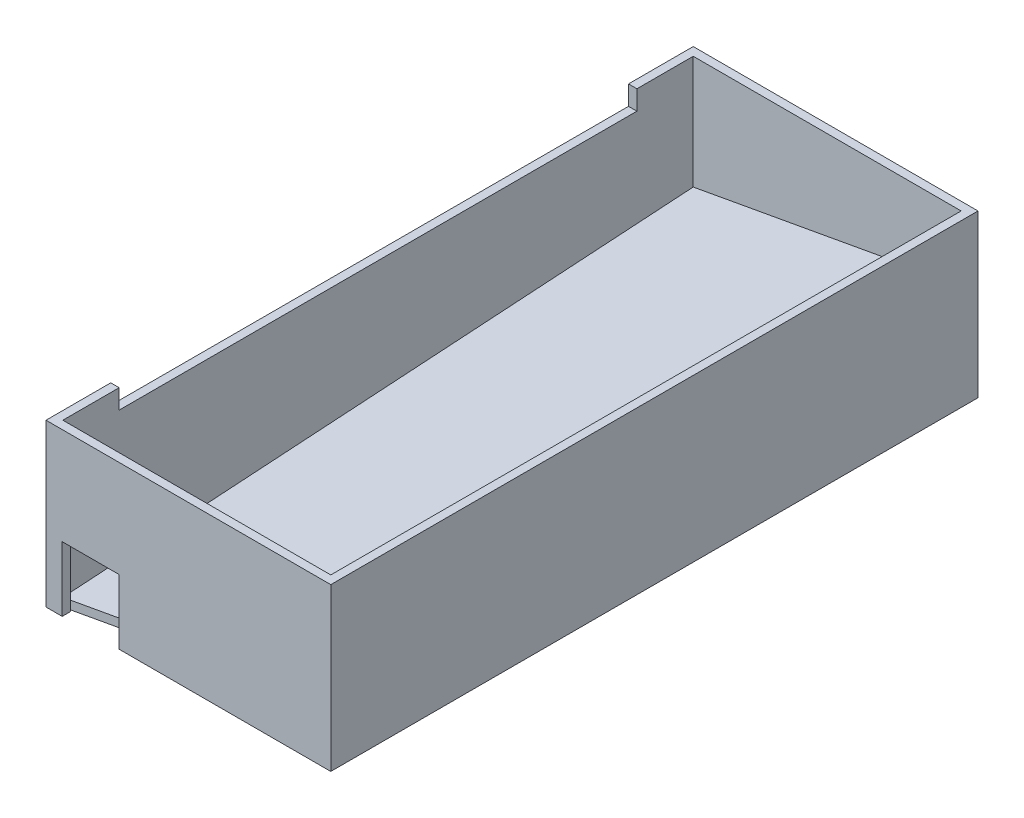
ISO-10303-21;
HEADER;
FILE_DESCRIPTION(('STEP AP214'),'2;1');
FILE_NAME('part.step','',(''),(''),'','','');
FILE_SCHEMA(('AUTOMOTIVE_DESIGN { 1 0 10303 214 1 1 1 1 }'));
ENDSEC;
DATA;
#1=APPLICATION_CONTEXT('core data for automotive mechanical design processes');
#2=APPLICATION_PROTOCOL_DEFINITION('international standard','automotive_design',2000,#1);
#3=PRODUCT_CONTEXT('',#1,'mechanical');
#4=PRODUCT('Part','Part','',(#3));
#5=PRODUCT_RELATED_PRODUCT_CATEGORY('part','',(#4));
#6=PRODUCT_DEFINITION_FORMATION('','',#4);
#7=PRODUCT_DEFINITION_CONTEXT('part definition',#1,'design');
#8=PRODUCT_DEFINITION('design','',#6,#7);
#9=PRODUCT_DEFINITION_SHAPE('','',#8);
#10=(LENGTH_UNIT() NAMED_UNIT(*) SI_UNIT(.MILLI.,.METRE.));
#11=(NAMED_UNIT(*) PLANE_ANGLE_UNIT() SI_UNIT($,.RADIAN.));
#12=(NAMED_UNIT(*) SI_UNIT($,.STERADIAN.) SOLID_ANGLE_UNIT());
#13=UNCERTAINTY_MEASURE_WITH_UNIT(LENGTH_MEASURE(1.E-05),#10,'distance_accuracy_value','');
#14=(GEOMETRIC_REPRESENTATION_CONTEXT(3) GLOBAL_UNCERTAINTY_ASSIGNED_CONTEXT((#13)) GLOBAL_UNIT_ASSIGNED_CONTEXT((#10,
#11,#12)) REPRESENTATION_CONTEXT('',''));
#15=CARTESIAN_POINT('',(0.,0.,0.));
#16=DIRECTION('',(0.,0.,1.));
#17=DIRECTION('',(1.,0.,0.));
#18=AXIS2_PLACEMENT_3D('',#15,#16,#17);
#19=CARTESIAN_POINT('',(3.302,15.748,-250.698));
#20=DIRECTION('',(-1.,0.,0.));
#21=DIRECTION('',(0.,0.,1.));
#22=AXIS2_PLACEMENT_3D('',#19,#20,#21);
#23=PLANE('',#22);
#24=CARTESIAN_POINT('',(3.302,19.05,-250.698));
#25=CARTESIAN_POINT('',(3.302,13.8006666666667,-168.232666666667));
#26=CARTESIAN_POINT('',(3.302,8.55133333333333,-85.7673333333333));
#27=CARTESIAN_POINT('',(3.302,3.302,-3.30199999999994));
#28=B_SPLINE_CURVE_WITH_KNOTS('',3,(#24,#25,#26,#27),.UNSPECIFIED.,.F.,.F.,(4,4),(0.,1.),.UNSPECIFIED.);
#29=CARTESIAN_POINT('',(3.302,19.05,-250.698));
#30=VERTEX_POINT('',#29);
#31=CARTESIAN_POINT('',(3.302,3.302,-3.30199999999994));
#32=VERTEX_POINT('',#31);
#33=EDGE_CURVE('E147',#30,#32,#28,.T.);
#34=ORIENTED_EDGE('',*,*,#33,.F.);
#35=DIRECTION('',(0.,1.,0.));
#36=VECTOR('',#35,1.);
#37=CARTESIAN_POINT('',(3.302,15.748,-250.698));
#38=LINE('',#37,#36);
#39=CARTESIAN_POINT('',(3.302,15.748,-250.698));
#40=VERTEX_POINT('',#39);
#41=EDGE_CURVE('E124',#40,#30,#38,.T.);
#42=ORIENTED_EDGE('',*,*,#41,.F.);
#43=CARTESIAN_POINT('',(3.302,15.748,-250.698));
#44=CARTESIAN_POINT('',(3.302,10.4986666666667,-168.232666666667));
#45=CARTESIAN_POINT('',(3.302,5.24933333333333,-85.7673333333333));
#46=CARTESIAN_POINT('',(3.302,0.,-3.30199999999994));
#47=B_SPLINE_CURVE_WITH_KNOTS('',3,(#43,#44,#45,#46),.UNSPECIFIED.,.F.,.F.,(4,4),(0.,1.),.UNSPECIFIED.);
#48=CARTESIAN_POINT('',(3.302,0.,-3.30199999999994));
#49=VERTEX_POINT('',#48);
#50=EDGE_CURVE('E114',#40,#49,#47,.T.);
#51=ORIENTED_EDGE('',*,*,#50,.T.);
#52=DIRECTION('',(0.,1.,0.));
#53=VECTOR('',#52,1.);
#54=CARTESIAN_POINT('',(3.302,0.,-3.30199999999994));
#55=LINE('',#54,#53);
#56=EDGE_CURVE('E14',#49,#32,#55,.T.);
#57=ORIENTED_EDGE('',*,*,#56,.T.);
#58=EDGE_LOOP('',(#34,#42,#51,#57));
#59=FACE_BOUND('',#58,.T.);
#60=ADVANCED_FACE('F68',(#59),#23,.T.);
#61=CARTESIAN_POINT('',(3.302,0.,-3.30199999999994));
#62=DIRECTION('',(0.,0.,1.));
#63=DIRECTION('',(1.,0.,0.));
#64=AXIS2_PLACEMENT_3D('',#61,#62,#63);
#65=PLANE('',#64);
#66=CARTESIAN_POINT('',(3.302,3.302,-3.30199999999994));
#67=CARTESIAN_POINT('',(38.354,9.65199999999999,-3.30199999999995));
#68=CARTESIAN_POINT('',(73.4059999999999,16.002,-3.30199999999996));
#69=CARTESIAN_POINT('',(108.458,22.352,-3.30199999999997));
#70=B_SPLINE_CURVE_WITH_KNOTS('',3,(#66,#67,#68,#69),.UNSPECIFIED.,.F.,.F.,(4,4),(0.,1.),.UNSPECIFIED.);
#71=CARTESIAN_POINT('',(108.458,22.352,-3.30199999999997));
#72=VERTEX_POINT('',#71);
#73=EDGE_CURVE('E139',#32,#72,#70,.T.);
#74=ORIENTED_EDGE('',*,*,#73,.F.);
#75=ORIENTED_EDGE('',*,*,#56,.F.);
#76=CARTESIAN_POINT('',(3.302,0.,-3.30199999999994));
#77=CARTESIAN_POINT('',(38.354,6.34999999999999,-3.30199999999995));
#78=CARTESIAN_POINT('',(73.4059999999999,12.7,-3.30199999999996));
#79=CARTESIAN_POINT('',(108.458,19.05,-3.30199999999997));
#80=B_SPLINE_CURVE_WITH_KNOTS('',3,(#76,#77,#78,#79),.UNSPECIFIED.,.F.,.F.,(4,4),(0.,1.),.UNSPECIFIED.);
#81=CARTESIAN_POINT('',(108.458,19.05,-3.30199999999997));
#82=VERTEX_POINT('',#81);
#83=EDGE_CURVE('E104',#49,#82,#80,.T.);
#84=ORIENTED_EDGE('',*,*,#83,.T.);
#85=DIRECTION('',(0.,1.,0.));
#86=VECTOR('',#85,1.);
#87=CARTESIAN_POINT('',(108.458,19.05,-3.30199999999997));
#88=LINE('',#87,#86);
#89=EDGE_CURVE('E74',#82,#72,#88,.T.);
#90=ORIENTED_EDGE('',*,*,#89,.T.);
#91=EDGE_LOOP('',(#74,#75,#84,#90));
#92=FACE_BOUND('',#91,.T.);
#93=ADVANCED_FACE('F110',(#92),#65,.T.);
#94=CARTESIAN_POINT('',(108.458,19.05,-3.30199999999997));
#95=DIRECTION('',(1.,0.,0.));
#96=DIRECTION('',(0.,0.,-1.));
#97=AXIS2_PLACEMENT_3D('',#94,#95,#96);
#98=PLANE('',#97);
#99=CARTESIAN_POINT('',(108.458,38.1,-250.698));
#100=CARTESIAN_POINT('',(108.458,32.8506666666667,-168.232666666667));
#101=CARTESIAN_POINT('',(108.458,27.6013333333333,-85.7673333333333));
#102=CARTESIAN_POINT('',(108.458,22.352,-3.30199999999997));
#103=B_SPLINE_CURVE_WITH_KNOTS('',3,(#99,#100,#101,#102),.UNSPECIFIED.,.F.,.F.,(4,4),(0.,1.),.UNSPECIFIED.);
#104=CARTESIAN_POINT('',(108.458,38.1,-250.698));
#105=VERTEX_POINT('',#104);
#106=EDGE_CURVE('E121',#72,#105,#103,.F.);
#107=ORIENTED_EDGE('',*,*,#106,.F.);
#108=ORIENTED_EDGE('',*,*,#89,.F.);
#109=CARTESIAN_POINT('',(108.458,34.798,-250.698));
#110=CARTESIAN_POINT('',(108.458,29.5486666666667,-168.232666666667));
#111=CARTESIAN_POINT('',(108.458,24.2993333333333,-85.7673333333333));
#112=CARTESIAN_POINT('',(108.458,19.05,-3.30199999999997));
#113=B_SPLINE_CURVE_WITH_KNOTS('',3,(#109,#110,#111,#112),.UNSPECIFIED.,.F.,.F.,(4,4),(0.,1.),.UNSPECIFIED.);
#114=CARTESIAN_POINT('',(108.458,34.798,-250.698));
#115=VERTEX_POINT('',#114);
#116=EDGE_CURVE('E113',#82,#115,#113,.F.);
#117=ORIENTED_EDGE('',*,*,#116,.T.);
#118=DIRECTION('',(0.,1.,0.));
#119=VECTOR('',#118,1.);
#120=CARTESIAN_POINT('',(108.458,34.798,-250.698));
#121=LINE('',#120,#119);
#122=EDGE_CURVE('E123',#115,#105,#121,.T.);
#123=ORIENTED_EDGE('',*,*,#122,.T.);
#124=EDGE_LOOP('',(#107,#108,#117,#123));
#125=FACE_BOUND('',#124,.T.);
#126=ADVANCED_FACE('F120',(#125),#98,.T.);
#127=CARTESIAN_POINT('',(108.458,34.798,-250.698));
#128=DIRECTION('',(0.,0.,-1.));
#129=DIRECTION('',(-1.,0.,0.));
#130=AXIS2_PLACEMENT_3D('',#127,#128,#129);
#131=PLANE('',#130);
#132=CARTESIAN_POINT('',(3.302,19.05,-250.698));
#133=CARTESIAN_POINT('',(38.354,25.4,-250.698));
#134=CARTESIAN_POINT('',(73.406,31.75,-250.698));
#135=CARTESIAN_POINT('',(108.458,38.1,-250.698));
#136=B_SPLINE_CURVE_WITH_KNOTS('',3,(#132,#133,#134,#135),.UNSPECIFIED.,.F.,.F.,(4,4),(0.,1.),.UNSPECIFIED.);
#137=EDGE_CURVE('E97',#105,#30,#136,.F.);
#138=ORIENTED_EDGE('',*,*,#137,.F.);
#139=ORIENTED_EDGE('',*,*,#122,.F.);
#140=CARTESIAN_POINT('',(3.302,15.748,-250.698));
#141=CARTESIAN_POINT('',(38.354,22.098,-250.698));
#142=CARTESIAN_POINT('',(73.406,28.448,-250.698));
#143=CARTESIAN_POINT('',(108.458,34.798,-250.698));
#144=B_SPLINE_CURVE_WITH_KNOTS('',3,(#140,#141,#142,#143),.UNSPECIFIED.,.F.,.F.,(4,4),(0.,1.),.UNSPECIFIED.);
#145=EDGE_CURVE('E82',#115,#40,#144,.F.);
#146=ORIENTED_EDGE('',*,*,#145,.T.);
#147=ORIENTED_EDGE('',*,*,#41,.T.);
#148=EDGE_LOOP('',(#138,#139,#146,#147));
#149=FACE_BOUND('',#148,.T.);
#150=ADVANCED_FACE('F186',(#149),#131,.T.);
#151=OPEN_SHELL('',(#60,#93,#126,#150));
#152=SHELL_BASED_SURFACE_MODEL('B2',(#151));
#153=CARTESIAN_POINT('',(3.302,19.05,-250.698));
#154=CARTESIAN_POINT('',(38.354,25.4,-250.698));
#155=CARTESIAN_POINT('',(73.406,31.75,-250.698));
#156=CARTESIAN_POINT('',(108.458,38.1,-250.698));
#157=CARTESIAN_POINT('',(3.302,13.8006666666667,-168.232666666667));
#158=CARTESIAN_POINT('',(38.354,20.1506666666667,-168.232666666667));
#159=CARTESIAN_POINT('',(73.406,26.5006666666667,-168.232666666667));
#160=CARTESIAN_POINT('',(108.458,32.8506666666667,-168.232666666667));
#161=CARTESIAN_POINT('',(3.302,8.55133333333333,-85.7673333333333));
#162=CARTESIAN_POINT('',(38.354,14.9013333333333,-85.7673333333333));
#163=CARTESIAN_POINT('',(73.406,21.2513333333333,-85.7673333333333));
#164=CARTESIAN_POINT('',(108.458,27.6013333333333,-85.7673333333333));
#165=CARTESIAN_POINT('',(3.302,3.302,-3.30199999999994));
#166=CARTESIAN_POINT('',(38.354,9.65199999999999,-3.30199999999995));
#167=CARTESIAN_POINT('',(73.4059999999999,16.002,-3.30199999999996));
#168=CARTESIAN_POINT('',(108.458,22.352,-3.30199999999997));
#169=B_SPLINE_SURFACE_WITH_KNOTS('',3,3,((#153,#154,#155,#156),(#157,#158,#159,#160),(#161,#162,
#163,#164),(#165,#166,#167,#168)),.UNSPECIFIED.,.F.,.F.,.F.,(4,4),(4,4),(0.,1.),(0.,1.),.UNSPECIFIED.);
#170=CARTESIAN_POINT('',(3.302,19.05,-250.698));
#171=CARTESIAN_POINT('',(3.302,13.8006666666667,-168.232666666667));
#172=CARTESIAN_POINT('',(3.302,8.55133333333333,-85.7673333333333));
#173=CARTESIAN_POINT('',(3.302,3.302,-3.30199999999994));
#174=B_SPLINE_CURVE_WITH_KNOTS('',3,(#170,#171,#172,#173),.UNSPECIFIED.,.F.,.F.,(4,4),(0.,1.),.UNSPECIFIED.);
#175=CARTESIAN_POINT('',(3.302,19.05,-250.698));
#176=VERTEX_POINT('',#175);
#177=CARTESIAN_POINT('',(3.302,3.302,-3.30199999999994));
#178=VERTEX_POINT('',#177);
#179=EDGE_CURVE('E66',#176,#178,#174,.T.);
#180=CARTESIAN_POINT('',(3.302,3.302,-3.30199999999994));
#181=CARTESIAN_POINT('',(38.354,9.65199999999999,-3.30199999999995));
#182=CARTESIAN_POINT('',(73.4059999999999,16.002,-3.30199999999996));
#183=CARTESIAN_POINT('',(108.458,22.352,-3.30199999999997));
#184=B_SPLINE_CURVE_WITH_KNOTS('',3,(#180,#181,#182,#183),.UNSPECIFIED.,.F.,.F.,(4,4),(0.,1.),.UNSPECIFIED.);
#185=CARTESIAN_POINT('',(108.458,22.352,-3.30199999999997));
#186=VERTEX_POINT('',#185);
#187=EDGE_CURVE('E254',#178,#186,#184,.T.);
#188=CARTESIAN_POINT('',(108.458,38.1,-250.698));
#189=CARTESIAN_POINT('',(108.458,32.8506666666667,-168.232666666667));
#190=CARTESIAN_POINT('',(108.458,27.6013333333333,-85.7673333333333));
#191=CARTESIAN_POINT('',(108.458,22.352,-3.30199999999997));
#192=B_SPLINE_CURVE_WITH_KNOTS('',3,(#188,#189,#190,#191),.UNSPECIFIED.,.F.,.F.,(4,4),(0.,1.),.UNSPECIFIED.);
#193=CARTESIAN_POINT('',(108.458,38.1,-250.698));
#194=VERTEX_POINT('',#193);
#195=EDGE_CURVE('E262',#186,#194,#192,.F.);
#196=CARTESIAN_POINT('',(3.302,19.05,-250.698));
#197=CARTESIAN_POINT('',(38.354,25.4,-250.698));
#198=CARTESIAN_POINT('',(73.406,31.75,-250.698));
#199=CARTESIAN_POINT('',(108.458,38.1,-250.698));
#200=B_SPLINE_CURVE_WITH_KNOTS('',3,(#196,#197,#198,#199),.UNSPECIFIED.,.F.,.F.,(4,4),(0.,1.),.UNSPECIFIED.);
#201=EDGE_CURVE('E246',#194,#176,#200,.F.);
#202=ORIENTED_EDGE('',*,*,#179,.T.);
#203=ORIENTED_EDGE('',*,*,#187,.T.);
#204=ORIENTED_EDGE('',*,*,#195,.T.);
#205=ORIENTED_EDGE('',*,*,#201,.T.);
#206=EDGE_LOOP('',(#202,#203,#204,#205));
#207=FACE_BOUND('',#206,.T.);
#208=ADVANCED_FACE('F243',(#207),#169,.T.);
#209=OPEN_SHELL('',(#208));
#210=SHELL_BASED_SURFACE_MODEL('B8',(#209));
#211=CARTESIAN_POINT('',(0.,63.5,0.));
#212=DIRECTION('',(0.,-1.,0.));
#213=DIRECTION('',(0.,0.,-1.));
#214=AXIS2_PLACEMENT_3D('',#211,#212,#213);
#215=PLANE('',#214);
#216=DIRECTION('',(0.,0.,1.));
#217=VECTOR('',#216,1.);
#218=CARTESIAN_POINT('',(0.,63.5,0.));
#219=LINE('',#218,#217);
#220=CARTESIAN_POINT('',(0.,63.5,-254.));
#221=VERTEX_POINT('',#220);
#222=CARTESIAN_POINT('',(0.,63.5,-228.6));
#223=VERTEX_POINT('',#222);
#224=EDGE_CURVE('E482',#221,#223,#219,.T.);
#225=ORIENTED_EDGE('',*,*,#224,.T.);
#226=DIRECTION('',(1.,0.,0.));
#227=VECTOR('',#226,1.);
#228=CARTESIAN_POINT('',(-60.198,63.5,-228.6));
#229=LINE('',#228,#227);
#230=CARTESIAN_POINT('',(3.302,63.5,-228.6));
#231=VERTEX_POINT('',#230);
#232=EDGE_CURVE('E528',#223,#231,#229,.T.);
#233=ORIENTED_EDGE('',*,*,#232,.T.);
#234=DIRECTION('',(0.,0.,1.));
#235=VECTOR('',#234,1.);
#236=CARTESIAN_POINT('',(3.302,63.5,-3.302));
#237=LINE('',#236,#235);
#238=CARTESIAN_POINT('',(3.302,63.5,-250.698));
#239=VERTEX_POINT('',#238);
#240=EDGE_CURVE('E545',#239,#231,#237,.T.);
#241=ORIENTED_EDGE('',*,*,#240,.F.);
#242=DIRECTION('',(-1.,0.,0.));
#243=VECTOR('',#242,1.);
#244=CARTESIAN_POINT('',(3.302,63.5,-250.698));
#245=LINE('',#244,#243);
#246=CARTESIAN_POINT('',(108.458,63.5,-250.698));
#247=VERTEX_POINT('',#246);
#248=EDGE_CURVE('E475',#247,#239,#245,.T.);
#249=ORIENTED_EDGE('',*,*,#248,.F.);
#250=DIRECTION('',(0.,0.,-1.));
#251=VECTOR('',#250,1.);
#252=CARTESIAN_POINT('',(108.458,63.5,-3.302));
#253=LINE('',#252,#251);
#254=CARTESIAN_POINT('',(108.458,63.5,-3.302));
#255=VERTEX_POINT('',#254);
#256=EDGE_CURVE('E549',#255,#247,#253,.T.);
#257=ORIENTED_EDGE('',*,*,#256,.F.);
#258=DIRECTION('',(1.,0.,0.));
#259=VECTOR('',#258,1.);
#260=CARTESIAN_POINT('',(3.302,63.5,-3.302));
#261=LINE('',#260,#259);
#262=CARTESIAN_POINT('',(3.302,63.5,-3.302));
#263=VERTEX_POINT('',#262);
#264=EDGE_CURVE('E547',#263,#255,#261,.T.);
#265=ORIENTED_EDGE('',*,*,#264,.F.);
#266=CARTESIAN_POINT('',(3.302,63.5,-25.4));
#267=VERTEX_POINT('',#266);
#268=EDGE_CURVE('E470',#267,#263,#237,.T.);
#269=ORIENTED_EDGE('',*,*,#268,.F.);
#270=DIRECTION('',(1.,0.,0.));
#271=VECTOR('',#270,1.);
#272=CARTESIAN_POINT('',(-60.198,63.5,-25.4));
#273=LINE('',#272,#271);
#274=CARTESIAN_POINT('',(0.,63.5,-25.4));
#275=VERTEX_POINT('',#274);
#276=EDGE_CURVE('E341',#275,#267,#273,.T.);
#277=ORIENTED_EDGE('',*,*,#276,.F.);
#278=CARTESIAN_POINT('',(0.,63.5,0.));
#279=VERTEX_POINT('',#278);
#280=EDGE_CURVE('E486',#275,#279,#219,.T.);
#281=ORIENTED_EDGE('',*,*,#280,.T.);
#282=DIRECTION('',(1.,0.,0.));
#283=VECTOR('',#282,1.);
#284=CARTESIAN_POINT('',(0.,63.5,0.));
#285=LINE('',#284,#283);
#286=CARTESIAN_POINT('',(111.76,63.5,0.));
#287=VERTEX_POINT('',#286);
#288=EDGE_CURVE('E485',#279,#287,#285,.T.);
#289=ORIENTED_EDGE('',*,*,#288,.T.);
#290=DIRECTION('',(0.,0.,-1.));
#291=VECTOR('',#290,1.);
#292=CARTESIAN_POINT('',(111.76,63.5,0.));
#293=LINE('',#292,#291);
#294=CARTESIAN_POINT('',(111.76,63.5,-254.));
#295=VERTEX_POINT('',#294);
#296=EDGE_CURVE('E488',#287,#295,#293,.T.);
#297=ORIENTED_EDGE('',*,*,#296,.T.);
#298=DIRECTION('',(-1.,0.,0.));
#299=VECTOR('',#298,1.);
#300=CARTESIAN_POINT('',(0.,63.5,-254.));
#301=LINE('',#300,#299);
#302=EDGE_CURVE('E490',#295,#221,#301,.T.);
#303=ORIENTED_EDGE('',*,*,#302,.T.);
#304=EDGE_LOOP('',(#225,#233,#241,#249,#257,#265,#269,#277,#281,#289,#297,#303));
#305=FACE_BOUND('',#304,.T.);
#306=ADVANCED_FACE('F318',(#305),#215,.F.);
#307=CARTESIAN_POINT('',(0.,0.,0.));
#308=DIRECTION('',(0.,-1.,0.));
#309=DIRECTION('',(0.,0.,-1.));
#310=AXIS2_PLACEMENT_3D('',#307,#308,#309);
#311=PLANE('',#310);
#312=DIRECTION('',(0.,0.,1.));
#313=VECTOR('',#312,1.);
#314=CARTESIAN_POINT('',(6.35,0.,-254.001));
#315=LINE('',#314,#313);
#316=CARTESIAN_POINT('',(6.35,0.,-3.302));
#317=VERTEX_POINT('',#316);
#318=CARTESIAN_POINT('',(6.35,0.,0.));
#319=VERTEX_POINT('',#318);
#320=EDGE_CURVE('E569',#317,#319,#315,.T.);
#321=ORIENTED_EDGE('',*,*,#320,.T.);
#322=DIRECTION('',(1.,0.,0.));
#323=VECTOR('',#322,1.);
#324=CARTESIAN_POINT('',(0.,0.,0.));
#325=LINE('',#324,#323);
#326=CARTESIAN_POINT('',(0.,0.,0.));
#327=VERTEX_POINT('',#326);
#328=EDGE_CURVE('E495',#327,#319,#325,.T.);
#329=ORIENTED_EDGE('',*,*,#328,.F.);
#330=DIRECTION('',(0.,0.,1.));
#331=VECTOR('',#330,1.);
#332=CARTESIAN_POINT('',(0.,0.,0.));
#333=LINE('',#332,#331);
#334=CARTESIAN_POINT('',(0.,0.,-254.));
#335=VERTEX_POINT('',#334);
#336=EDGE_CURVE('E481',#335,#327,#333,.T.);
#337=ORIENTED_EDGE('',*,*,#336,.F.);
#338=DIRECTION('',(-1.,0.,0.));
#339=VECTOR('',#338,1.);
#340=CARTESIAN_POINT('',(0.,0.,-254.));
#341=LINE('',#340,#339);
#342=CARTESIAN_POINT('',(111.76,0.,-254.));
#343=VERTEX_POINT('',#342);
#344=EDGE_CURVE('E500',#343,#335,#341,.T.);
#345=ORIENTED_EDGE('',*,*,#344,.F.);
#346=DIRECTION('',(0.,0.,-1.));
#347=VECTOR('',#346,1.);
#348=CARTESIAN_POINT('',(111.76,0.,0.));
#349=LINE('',#348,#347);
#350=CARTESIAN_POINT('',(111.76,0.,0.));
#351=VERTEX_POINT('',#350);
#352=EDGE_CURVE('E498',#351,#343,#349,.T.);
#353=ORIENTED_EDGE('',*,*,#352,.F.);
#354=CARTESIAN_POINT('',(28.702,0.,0.));
#355=VERTEX_POINT('',#354);
#356=EDGE_CURVE('E448',#355,#351,#325,.T.);
#357=ORIENTED_EDGE('',*,*,#356,.F.);
#358=DIRECTION('',(0.,0.,1.));
#359=VECTOR('',#358,1.);
#360=CARTESIAN_POINT('',(28.702,0.,-254.001));
#361=LINE('',#360,#359);
#362=CARTESIAN_POINT('',(28.702,0.,-3.30200000000003));
#363=VERTEX_POINT('',#362);
#364=EDGE_CURVE('E433',#363,#355,#361,.T.);
#365=ORIENTED_EDGE('',*,*,#364,.F.);
#366=DIRECTION('',(1.,0.,0.));
#367=VECTOR('',#366,1.);
#368=CARTESIAN_POINT('',(3.302,0.,-3.302));
#369=LINE('',#368,#367);
#370=CARTESIAN_POINT('',(108.458,0.,-3.302));
#371=VERTEX_POINT('',#370);
#372=EDGE_CURVE('E445',#363,#371,#369,.T.);
#373=ORIENTED_EDGE('',*,*,#372,.T.);
#374=DIRECTION('',(0.,0.,-1.));
#375=VECTOR('',#374,1.);
#376=CARTESIAN_POINT('',(108.458,0.,-3.302));
#377=LINE('',#376,#375);
#378=CARTESIAN_POINT('',(108.458,0.,-250.698));
#379=VERTEX_POINT('',#378);
#380=EDGE_CURVE('E460',#371,#379,#377,.T.);
#381=ORIENTED_EDGE('',*,*,#380,.T.);
#382=DIRECTION('',(-1.,0.,0.));
#383=VECTOR('',#382,1.);
#384=CARTESIAN_POINT('',(3.302,0.,-250.698));
#385=LINE('',#384,#383);
#386=CARTESIAN_POINT('',(3.302,0.,-250.698));
#387=VERTEX_POINT('',#386);
#388=EDGE_CURVE('E467',#379,#387,#385,.T.);
#389=ORIENTED_EDGE('',*,*,#388,.T.);
#390=DIRECTION('',(0.,0.,1.));
#391=VECTOR('',#390,1.);
#392=CARTESIAN_POINT('',(3.302,0.,-3.302));
#393=LINE('',#392,#391);
#394=CARTESIAN_POINT('',(3.302,0.,-3.302));
#395=VERTEX_POINT('',#394);
#396=EDGE_CURVE('E457',#387,#395,#393,.T.);
#397=ORIENTED_EDGE('',*,*,#396,.T.);
#398=EDGE_CURVE('E456',#395,#317,#369,.T.);
#399=ORIENTED_EDGE('',*,*,#398,.T.);
#400=EDGE_LOOP('',(#321,#329,#337,#345,#353,#357,#365,#373,#381,#389,#397,#399));
#401=FACE_BOUND('',#400,.T.);
#402=ADVANCED_FACE('F443',(#401),#311,.T.);
#403=CARTESIAN_POINT('',(0.,63.5,0.));
#404=DIRECTION('',(1.,0.,0.));
#405=DIRECTION('',(0.,0.,-1.));
#406=AXIS2_PLACEMENT_3D('',#403,#404,#405);
#407=PLANE('',#406);
#408=DIRECTION('',(0.,0.,-1.));
#409=VECTOR('',#408,1.);
#410=CARTESIAN_POINT('',(0.,55.88,0.));
#411=LINE('',#410,#409);
#412=CARTESIAN_POINT('',(0.,55.88,-25.4));
#413=VERTEX_POINT('',#412);
#414=CARTESIAN_POINT('',(0.,55.88,-228.6));
#415=VERTEX_POINT('',#414);
#416=EDGE_CURVE('E534',#413,#415,#411,.T.);
#417=ORIENTED_EDGE('',*,*,#416,.T.);
#418=DIRECTION('',(0.,1.,0.));
#419=VECTOR('',#418,1.);
#420=CARTESIAN_POINT('',(0.,63.5,-228.6));
#421=LINE('',#420,#419);
#422=EDGE_CURVE('E462',#415,#223,#421,.T.);
#423=ORIENTED_EDGE('',*,*,#422,.T.);
#424=ORIENTED_EDGE('',*,*,#224,.F.);
#425=DIRECTION('',(0.,-1.,0.));
#426=VECTOR('',#425,1.);
#427=CARTESIAN_POINT('',(0.,63.5,-254.));
#428=LINE('',#427,#426);
#429=EDGE_CURVE('E492',#221,#335,#428,.T.);
#430=ORIENTED_EDGE('',*,*,#429,.T.);
#431=ORIENTED_EDGE('',*,*,#336,.T.);
#432=DIRECTION('',(0.,-1.,0.));
#433=VECTOR('',#432,1.);
#434=CARTESIAN_POINT('',(0.,63.5,0.));
#435=LINE('',#434,#433);
#436=EDGE_CURVE('E241',#279,#327,#435,.T.);
#437=ORIENTED_EDGE('',*,*,#436,.F.);
#438=ORIENTED_EDGE('',*,*,#280,.F.);
#439=DIRECTION('',(0.,-1.,0.));
#440=VECTOR('',#439,1.);
#441=CARTESIAN_POINT('',(0.,63.5,-25.4));
#442=LINE('',#441,#440);
#443=EDGE_CURVE('E533',#275,#413,#442,.T.);
#444=ORIENTED_EDGE('',*,*,#443,.T.);
#445=EDGE_LOOP('',(#417,#423,#424,#430,#431,#437,#438,#444));
#446=FACE_BOUND('',#445,.T.);
#447=ADVANCED_FACE('F320',(#446),#407,.F.);
#448=CARTESIAN_POINT('',(0.,63.5,0.));
#449=DIRECTION('',(0.,0.,-1.));
#450=DIRECTION('',(-1.,0.,0.));
#451=AXIS2_PLACEMENT_3D('',#448,#449,#450);
#452=PLANE('',#451);
#453=ORIENTED_EDGE('',*,*,#328,.T.);
#454=DIRECTION('',(0.,-1.,0.));
#455=VECTOR('',#454,1.);
#456=CARTESIAN_POINT('',(6.35,0.,0.));
#457=LINE('',#456,#455);
#458=CARTESIAN_POINT('',(6.35,25.4,0.));
#459=VERTEX_POINT('',#458);
#460=EDGE_CURVE('E449',#459,#319,#457,.T.);
#461=ORIENTED_EDGE('',*,*,#460,.F.);
#462=DIRECTION('',(-1.,0.,0.));
#463=VECTOR('',#462,1.);
#464=CARTESIAN_POINT('',(6.35,25.4,0.));
#465=LINE('',#464,#463);
#466=CARTESIAN_POINT('',(28.702,25.4,0.));
#467=VERTEX_POINT('',#466);
#468=EDGE_CURVE('E581',#467,#459,#465,.T.);
#469=ORIENTED_EDGE('',*,*,#468,.F.);
#470=DIRECTION('',(0.,1.,0.));
#471=VECTOR('',#470,1.);
#472=CARTESIAN_POINT('',(28.702,0.,0.));
#473=LINE('',#472,#471);
#474=EDGE_CURVE('E723',#355,#467,#473,.T.);
#475=ORIENTED_EDGE('',*,*,#474,.F.);
#476=ORIENTED_EDGE('',*,*,#356,.T.);
#477=DIRECTION('',(0.,-1.,0.));
#478=VECTOR('',#477,1.);
#479=CARTESIAN_POINT('',(111.76,63.5,0.));
#480=LINE('',#479,#478);
#481=EDGE_CURVE('E326',#287,#351,#480,.T.);
#482=ORIENTED_EDGE('',*,*,#481,.F.);
#483=ORIENTED_EDGE('',*,*,#288,.F.);
#484=ORIENTED_EDGE('',*,*,#436,.T.);
#485=EDGE_LOOP('',(#453,#461,#469,#475,#476,#482,#483,#484));
#486=FACE_BOUND('',#485,.T.);
#487=ADVANCED_FACE('F531',(#486),#452,.F.);
#488=CARTESIAN_POINT('',(111.76,63.5,0.));
#489=DIRECTION('',(-1.,0.,0.));
#490=DIRECTION('',(0.,0.,1.));
#491=AXIS2_PLACEMENT_3D('',#488,#489,#490);
#492=PLANE('',#491);
#493=ORIENTED_EDGE('',*,*,#352,.T.);
#494=DIRECTION('',(0.,-1.,0.));
#495=VECTOR('',#494,1.);
#496=CARTESIAN_POINT('',(111.76,63.5,-254.));
#497=LINE('',#496,#495);
#498=EDGE_CURVE('E504',#295,#343,#497,.T.);
#499=ORIENTED_EDGE('',*,*,#498,.F.);
#500=ORIENTED_EDGE('',*,*,#296,.F.);
#501=ORIENTED_EDGE('',*,*,#481,.T.);
#502=EDGE_LOOP('',(#493,#499,#500,#501));
#503=FACE_BOUND('',#502,.T.);
#504=ADVANCED_FACE('F510',(#503),#492,.F.);
#505=CARTESIAN_POINT('',(0.,63.5,-254.));
#506=DIRECTION('',(0.,0.,1.));
#507=DIRECTION('',(1.,0.,0.));
#508=AXIS2_PLACEMENT_3D('',#505,#506,#507);
#509=PLANE('',#508);
#510=ORIENTED_EDGE('',*,*,#344,.T.);
#511=ORIENTED_EDGE('',*,*,#429,.F.);
#512=ORIENTED_EDGE('',*,*,#302,.F.);
#513=ORIENTED_EDGE('',*,*,#498,.T.);
#514=EDGE_LOOP('',(#510,#511,#512,#513));
#515=FACE_BOUND('',#514,.T.);
#516=ADVANCED_FACE('F518',(#515),#509,.F.);
#517=CARTESIAN_POINT('',(3.302,63.5,-3.302));
#518=DIRECTION('',(1.,0.,0.));
#519=DIRECTION('',(0.,0.,-1.));
#520=AXIS2_PLACEMENT_3D('',#517,#518,#519);
#521=PLANE('',#520);
#522=DIRECTION('',(0.,1.,0.));
#523=VECTOR('',#522,1.);
#524=CARTESIAN_POINT('',(3.302,63.5,-228.6));
#525=LINE('',#524,#523);
#526=CARTESIAN_POINT('',(3.302,55.88,-228.6));
#527=VERTEX_POINT('',#526);
#528=EDGE_CURVE('E578',#527,#231,#525,.T.);
#529=ORIENTED_EDGE('',*,*,#528,.F.);
#530=DIRECTION('',(0.,0.,-1.));
#531=VECTOR('',#530,1.);
#532=CARTESIAN_POINT('',(3.302,55.88,-228.6));
#533=LINE('',#532,#531);
#534=CARTESIAN_POINT('',(3.302,55.88,-25.4));
#535=VERTEX_POINT('',#534);
#536=EDGE_CURVE('E583',#535,#527,#533,.T.);
#537=ORIENTED_EDGE('',*,*,#536,.F.);
#538=DIRECTION('',(0.,-1.,0.));
#539=VECTOR('',#538,1.);
#540=CARTESIAN_POINT('',(3.302,63.5,-25.4));
#541=LINE('',#540,#539);
#542=EDGE_CURVE('E580',#267,#535,#541,.T.);
#543=ORIENTED_EDGE('',*,*,#542,.F.);
#544=ORIENTED_EDGE('',*,*,#268,.T.);
#545=DIRECTION('',(0.,-1.,0.));
#546=VECTOR('',#545,1.);
#547=CARTESIAN_POINT('',(3.302,63.5,-3.302));
#548=LINE('',#547,#546);
#549=EDGE_CURVE('E478',#263,#395,#548,.T.);
#550=ORIENTED_EDGE('',*,*,#549,.T.);
#551=ORIENTED_EDGE('',*,*,#396,.F.);
#552=DIRECTION('',(0.,-1.,0.));
#553=VECTOR('',#552,1.);
#554=CARTESIAN_POINT('',(3.302,63.5,-250.698));
#555=LINE('',#554,#553);
#556=EDGE_CURVE('E471',#239,#387,#555,.T.);
#557=ORIENTED_EDGE('',*,*,#556,.F.);
#558=ORIENTED_EDGE('',*,*,#240,.T.);
#559=EDGE_LOOP('',(#529,#537,#543,#544,#550,#551,#557,#558));
#560=FACE_BOUND('',#559,.T.);
#561=ADVANCED_FACE('F559',(#560),#521,.T.);
#562=CARTESIAN_POINT('',(3.302,63.5,-3.302));
#563=DIRECTION('',(0.,0.,-1.));
#564=DIRECTION('',(-1.,0.,0.));
#565=AXIS2_PLACEMENT_3D('',#562,#563,#564);
#566=PLANE('',#565);
#567=DIRECTION('',(0.,-1.,0.));
#568=VECTOR('',#567,1.);
#569=CARTESIAN_POINT('',(6.35,0.,-3.30200000000003));
#570=LINE('',#569,#568);
#571=CARTESIAN_POINT('',(6.35,25.4,-3.30200000000003));
#572=VERTEX_POINT('',#571);
#573=EDGE_CURVE('E565',#572,#317,#570,.T.);
#574=ORIENTED_EDGE('',*,*,#573,.T.);
#575=ORIENTED_EDGE('',*,*,#398,.F.);
#576=ORIENTED_EDGE('',*,*,#549,.F.);
#577=ORIENTED_EDGE('',*,*,#264,.T.);
#578=DIRECTION('',(0.,-1.,0.));
#579=VECTOR('',#578,1.);
#580=CARTESIAN_POINT('',(108.458,63.5,-3.302));
#581=LINE('',#580,#579);
#582=EDGE_CURVE('E454',#255,#371,#581,.T.);
#583=ORIENTED_EDGE('',*,*,#582,.T.);
#584=ORIENTED_EDGE('',*,*,#372,.F.);
#585=DIRECTION('',(0.,1.,0.));
#586=VECTOR('',#585,1.);
#587=CARTESIAN_POINT('',(28.702,0.,-3.30200000000003));
#588=LINE('',#587,#586);
#589=CARTESIAN_POINT('',(28.702,25.4,-3.302));
#590=VERTEX_POINT('',#589);
#591=EDGE_CURVE('E430',#363,#590,#588,.T.);
#592=ORIENTED_EDGE('',*,*,#591,.T.);
#593=DIRECTION('',(-1.,0.,0.));
#594=VECTOR('',#593,1.);
#595=CARTESIAN_POINT('',(6.35,25.4,-3.30200000000003));
#596=LINE('',#595,#594);
#597=EDGE_CURVE('E566',#590,#572,#596,.T.);
#598=ORIENTED_EDGE('',*,*,#597,.T.);
#599=EDGE_LOOP('',(#574,#575,#576,#577,#583,#584,#592,#598));
#600=FACE_BOUND('',#599,.T.);
#601=ADVANCED_FACE('F452',(#600),#566,.T.);
#602=CARTESIAN_POINT('',(108.458,63.5,-3.302));
#603=DIRECTION('',(-1.,0.,0.));
#604=DIRECTION('',(0.,0.,1.));
#605=AXIS2_PLACEMENT_3D('',#602,#603,#604);
#606=PLANE('',#605);
#607=ORIENTED_EDGE('',*,*,#380,.F.);
#608=ORIENTED_EDGE('',*,*,#582,.F.);
#609=ORIENTED_EDGE('',*,*,#256,.T.);
#610=DIRECTION('',(0.,-1.,0.));
#611=VECTOR('',#610,1.);
#612=CARTESIAN_POINT('',(108.458,63.5,-250.698));
#613=LINE('',#612,#611);
#614=EDGE_CURVE('E474',#247,#379,#613,.T.);
#615=ORIENTED_EDGE('',*,*,#614,.T.);
#616=EDGE_LOOP('',(#607,#608,#609,#615));
#617=FACE_BOUND('',#616,.T.);
#618=ADVANCED_FACE('F562',(#617),#606,.T.);
#619=CARTESIAN_POINT('',(3.302,63.5,-250.698));
#620=DIRECTION('',(0.,0.,1.));
#621=DIRECTION('',(1.,0.,0.));
#622=AXIS2_PLACEMENT_3D('',#619,#620,#621);
#623=PLANE('',#622);
#624=ORIENTED_EDGE('',*,*,#388,.F.);
#625=ORIENTED_EDGE('',*,*,#614,.F.);
#626=ORIENTED_EDGE('',*,*,#248,.T.);
#627=ORIENTED_EDGE('',*,*,#556,.T.);
#628=EDGE_LOOP('',(#624,#625,#626,#627));
#629=FACE_BOUND('',#628,.T.);
#630=ADVANCED_FACE('F555',(#629),#623,.T.);
#631=CARTESIAN_POINT('',(-60.198,63.5,-228.6));
#632=DIRECTION('',(0.,0.,-1.));
#633=DIRECTION('',(-1.,0.,0.));
#634=AXIS2_PLACEMENT_3D('',#631,#632,#633);
#635=PLANE('',#634);
#636=DIRECTION('',(1.,0.,0.));
#637=VECTOR('',#636,1.);
#638=CARTESIAN_POINT('',(-60.198,55.88,-228.6));
#639=LINE('',#638,#637);
#640=EDGE_CURVE('E536',#415,#527,#639,.T.);
#641=ORIENTED_EDGE('',*,*,#640,.T.);
#642=ORIENTED_EDGE('',*,*,#528,.T.);
#643=ORIENTED_EDGE('',*,*,#232,.F.);
#644=ORIENTED_EDGE('',*,*,#422,.F.);
#645=EDGE_LOOP('',(#641,#642,#643,#644));
#646=FACE_BOUND('',#645,.T.);
#647=ADVANCED_FACE('F592',(#646),#635,.F.);
#648=CARTESIAN_POINT('',(-60.198,55.88,-228.6));
#649=DIRECTION('',(0.,-1.,0.));
#650=DIRECTION('',(0.,0.,-1.));
#651=AXIS2_PLACEMENT_3D('',#648,#649,#650);
#652=PLANE('',#651);
#653=DIRECTION('',(1.,0.,0.));
#654=VECTOR('',#653,1.);
#655=CARTESIAN_POINT('',(-60.198,55.88,-25.4));
#656=LINE('',#655,#654);
#657=EDGE_CURVE('E539',#413,#535,#656,.T.);
#658=ORIENTED_EDGE('',*,*,#657,.T.);
#659=ORIENTED_EDGE('',*,*,#536,.T.);
#660=ORIENTED_EDGE('',*,*,#640,.F.);
#661=ORIENTED_EDGE('',*,*,#416,.F.);
#662=EDGE_LOOP('',(#658,#659,#660,#661));
#663=FACE_BOUND('',#662,.T.);
#664=ADVANCED_FACE('F587',(#663),#652,.F.);
#665=CARTESIAN_POINT('',(-60.198,63.5,-25.4));
#666=DIRECTION('',(0.,0.,1.));
#667=DIRECTION('',(1.,0.,0.));
#668=AXIS2_PLACEMENT_3D('',#665,#666,#667);
#669=PLANE('',#668);
#670=ORIENTED_EDGE('',*,*,#276,.T.);
#671=ORIENTED_EDGE('',*,*,#542,.T.);
#672=ORIENTED_EDGE('',*,*,#657,.F.);
#673=ORIENTED_EDGE('',*,*,#443,.F.);
#674=EDGE_LOOP('',(#670,#671,#672,#673));
#675=FACE_BOUND('',#674,.T.);
#676=ADVANCED_FACE('F590',(#675),#669,.F.);
#677=CARTESIAN_POINT('',(6.35,0.,-254.001));
#678=DIRECTION('',(-1.,0.,0.));
#679=DIRECTION('',(0.,0.,1.));
#680=AXIS2_PLACEMENT_3D('',#677,#678,#679);
#681=PLANE('',#680);
#682=DIRECTION('',(0.,0.,1.));
#683=VECTOR('',#682,1.);
#684=CARTESIAN_POINT('',(6.35,25.4,-254.001));
#685=LINE('',#684,#683);
#686=EDGE_CURVE('E438',#572,#459,#685,.T.);
#687=ORIENTED_EDGE('',*,*,#686,.T.);
#688=ORIENTED_EDGE('',*,*,#460,.T.);
#689=ORIENTED_EDGE('',*,*,#320,.F.);
#690=ORIENTED_EDGE('',*,*,#573,.F.);
#691=EDGE_LOOP('',(#687,#688,#689,#690));
#692=FACE_BOUND('',#691,.T.);
#693=ADVANCED_FACE('F652',(#692),#681,.F.);
#694=CARTESIAN_POINT('',(6.35,25.4,-254.001));
#695=DIRECTION('',(0.,1.,0.));
#696=DIRECTION('',(0.,0.,1.));
#697=AXIS2_PLACEMENT_3D('',#694,#695,#696);
#698=PLANE('',#697);
#699=DIRECTION('',(0.,0.,1.));
#700=VECTOR('',#699,1.);
#701=CARTESIAN_POINT('',(28.702,25.4,-254.001));
#702=LINE('',#701,#700);
#703=EDGE_CURVE('E333',#590,#467,#702,.T.);
#704=ORIENTED_EDGE('',*,*,#703,.T.);
#705=ORIENTED_EDGE('',*,*,#468,.T.);
#706=ORIENTED_EDGE('',*,*,#686,.F.);
#707=ORIENTED_EDGE('',*,*,#597,.F.);
#708=EDGE_LOOP('',(#704,#705,#706,#707));
#709=FACE_BOUND('',#708,.T.);
#710=ADVANCED_FACE('F657',(#709),#698,.F.);
#711=CARTESIAN_POINT('',(28.702,0.,-254.001));
#712=DIRECTION('',(1.,0.,0.));
#713=DIRECTION('',(0.,0.,-1.));
#714=AXIS2_PLACEMENT_3D('',#711,#712,#713);
#715=PLANE('',#714);
#716=ORIENTED_EDGE('',*,*,#364,.T.);
#717=ORIENTED_EDGE('',*,*,#474,.T.);
#718=ORIENTED_EDGE('',*,*,#703,.F.);
#719=ORIENTED_EDGE('',*,*,#591,.F.);
#720=EDGE_LOOP('',(#716,#717,#718,#719));
#721=FACE_BOUND('',#720,.T.);
#722=ADVANCED_FACE('F432',(#721),#715,.F.);
#723=CLOSED_SHELL('',(#306,#402,#447,#487,#504,#516,#561,#601,#618,#630,#647,#664,#676,#693,
#710,#722));
#724=MANIFOLD_SOLID_BREP('B60',#723);
#725=ADVANCED_BREP_SHAPE_REPRESENTATION('',(#18,#724),#14);
#726=MANIFOLD_SURFACE_SHAPE_REPRESENTATION('',(#18,#152,#210),#14);
#727=SHAPE_REPRESENTATION('',(#18),#14);
#728=SHAPE_DEFINITION_REPRESENTATION(#9,#727);
#729=SHAPE_REPRESENTATION_RELATIONSHIP('','',#727,#725);
#730=SHAPE_REPRESENTATION_RELATIONSHIP('','',#727,#726);
ENDSEC;
END-ISO-10303-21;
